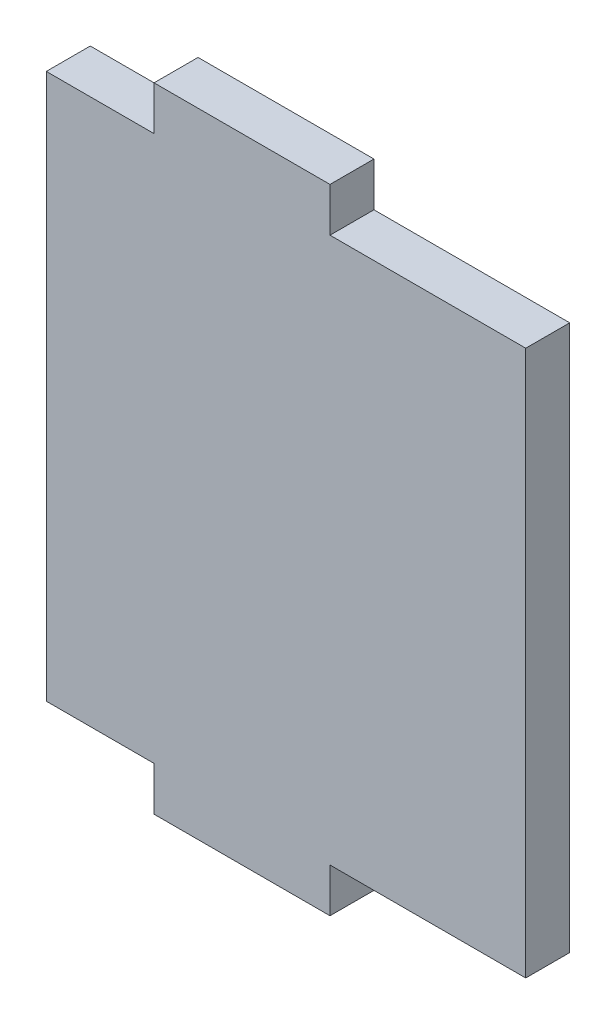
ISO-10303-21;
HEADER;
FILE_DESCRIPTION(('STEP AP214'),'2;1');
FILE_NAME('part.step','',(''),(''),'','','');
FILE_SCHEMA(('AUTOMOTIVE_DESIGN { 1 0 10303 214 1 1 1 1 }'));
ENDSEC;
DATA;
#1=APPLICATION_CONTEXT('core data for automotive mechanical design processes');
#2=APPLICATION_PROTOCOL_DEFINITION('international standard','automotive_design',2000,#1);
#3=PRODUCT_CONTEXT('',#1,'mechanical');
#4=PRODUCT('Part','Part','',(#3));
#5=PRODUCT_RELATED_PRODUCT_CATEGORY('part','',(#4));
#6=PRODUCT_DEFINITION_FORMATION('','',#4);
#7=PRODUCT_DEFINITION_CONTEXT('part definition',#1,'design');
#8=PRODUCT_DEFINITION('design','',#6,#7);
#9=PRODUCT_DEFINITION_SHAPE('','',#8);
#10=(LENGTH_UNIT() NAMED_UNIT(*) SI_UNIT(.MILLI.,.METRE.));
#11=(NAMED_UNIT(*) PLANE_ANGLE_UNIT() SI_UNIT($,.RADIAN.));
#12=(NAMED_UNIT(*) SI_UNIT($,.STERADIAN.) SOLID_ANGLE_UNIT());
#13=UNCERTAINTY_MEASURE_WITH_UNIT(LENGTH_MEASURE(1.E-05),#10,'distance_accuracy_value','');
#14=(GEOMETRIC_REPRESENTATION_CONTEXT(3) GLOBAL_UNCERTAINTY_ASSIGNED_CONTEXT((#13)) GLOBAL_UNIT_ASSIGNED_CONTEXT((#10,
#11,#12)) REPRESENTATION_CONTEXT('',''));
#15=CARTESIAN_POINT('',(0.,0.,0.));
#16=DIRECTION('',(0.,0.,1.));
#17=DIRECTION('',(1.,0.,0.));
#18=AXIS2_PLACEMENT_3D('',#15,#16,#17);
#19=CARTESIAN_POINT('',(27.25,0.,5.));
#20=DIRECTION('',(1.,0.,0.));
#21=DIRECTION('',(0.,1.,0.));
#22=AXIS2_PLACEMENT_3D('',#19,#20,#21);
#23=PLANE('',#22);
#24=DIRECTION('',(0.,-1.,0.));
#25=VECTOR('',#24,1.);
#26=CARTESIAN_POINT('',(27.25,0.,0.));
#27=LINE('',#26,#25);
#28=CARTESIAN_POINT('',(27.25,31.,0.));
#29=VERTEX_POINT('',#28);
#30=CARTESIAN_POINT('',(27.25,-31.,0.));
#31=VERTEX_POINT('',#30);
#32=EDGE_CURVE('E150',#29,#31,#27,.T.);
#33=ORIENTED_EDGE('',*,*,#32,.F.);
#34=DIRECTION('',(0.,0.,-1.));
#35=VECTOR('',#34,1.);
#36=CARTESIAN_POINT('',(27.25,31.,5.));
#37=LINE('',#36,#35);
#38=CARTESIAN_POINT('',(27.25,31.,5.));
#39=VERTEX_POINT('',#38);
#40=EDGE_CURVE('E11',#39,#29,#37,.T.);
#41=ORIENTED_EDGE('',*,*,#40,.F.);
#42=DIRECTION('',(0.,-1.,0.));
#43=VECTOR('',#42,1.);
#44=CARTESIAN_POINT('',(27.25,0.,5.));
#45=LINE('',#44,#43);
#46=CARTESIAN_POINT('',(27.25,-31.,5.));
#47=VERTEX_POINT('',#46);
#48=EDGE_CURVE('E179',#39,#47,#45,.T.);
#49=ORIENTED_EDGE('',*,*,#48,.T.);
#50=DIRECTION('',(0.,0.,-1.));
#51=VECTOR('',#50,1.);
#52=CARTESIAN_POINT('',(27.25,-31.,5.));
#53=LINE('',#52,#51);
#54=EDGE_CURVE('E96',#47,#31,#53,.T.);
#55=ORIENTED_EDGE('',*,*,#54,.T.);
#56=EDGE_LOOP('',(#33,#41,#49,#55));
#57=FACE_BOUND('',#56,.T.);
#58=ADVANCED_FACE('F34',(#57),#23,.T.);
#59=CARTESIAN_POINT('',(0.,31.,5.));
#60=DIRECTION('',(0.,1.,0.));
#61=DIRECTION('',(0.,0.,1.));
#62=AXIS2_PLACEMENT_3D('',#59,#60,#61);
#63=PLANE('',#62);
#64=DIRECTION('',(1.,0.,0.));
#65=VECTOR('',#64,1.);
#66=CARTESIAN_POINT('',(0.,31.,0.));
#67=LINE('',#66,#65);
#68=CARTESIAN_POINT('',(5.,31.,0.));
#69=VERTEX_POINT('',#68);
#70=EDGE_CURVE('E153',#69,#29,#67,.T.);
#71=ORIENTED_EDGE('',*,*,#70,.F.);
#72=DIRECTION('',(0.,0.,-1.));
#73=VECTOR('',#72,1.);
#74=CARTESIAN_POINT('',(5.,31.,5.));
#75=LINE('',#74,#73);
#76=CARTESIAN_POINT('',(5.,31.,5.));
#77=VERTEX_POINT('',#76);
#78=EDGE_CURVE('E42',#77,#69,#75,.T.);
#79=ORIENTED_EDGE('',*,*,#78,.F.);
#80=DIRECTION('',(1.,0.,0.));
#81=VECTOR('',#80,1.);
#82=CARTESIAN_POINT('',(0.,31.,5.));
#83=LINE('',#82,#81);
#84=EDGE_CURVE('E212',#77,#39,#83,.T.);
#85=ORIENTED_EDGE('',*,*,#84,.T.);
#86=ORIENTED_EDGE('',*,*,#40,.T.);
#87=EDGE_LOOP('',(#71,#79,#85,#86));
#88=FACE_BOUND('',#87,.T.);
#89=ADVANCED_FACE('F211',(#88),#63,.T.);
#90=CARTESIAN_POINT('',(5.,0.,5.));
#91=DIRECTION('',(-1.,0.,0.));
#92=DIRECTION('',(0.,0.,1.));
#93=AXIS2_PLACEMENT_3D('',#90,#91,#92);
#94=PLANE('',#93);
#95=DIRECTION('',(0.,1.,0.));
#96=VECTOR('',#95,1.);
#97=CARTESIAN_POINT('',(5.,0.,0.));
#98=LINE('',#97,#96);
#99=CARTESIAN_POINT('',(5.,36.,0.));
#100=VERTEX_POINT('',#99);
#101=EDGE_CURVE('E156',#69,#100,#98,.T.);
#102=ORIENTED_EDGE('',*,*,#101,.T.);
#103=DIRECTION('',(0.,0.,-1.));
#104=VECTOR('',#103,1.);
#105=CARTESIAN_POINT('',(5.,36.,5.));
#106=LINE('',#105,#104);
#107=CARTESIAN_POINT('',(5.,36.,5.));
#108=VERTEX_POINT('',#107);
#109=EDGE_CURVE('E195',#108,#100,#106,.T.);
#110=ORIENTED_EDGE('',*,*,#109,.F.);
#111=DIRECTION('',(0.,1.,0.));
#112=VECTOR('',#111,1.);
#113=CARTESIAN_POINT('',(5.,0.,5.));
#114=LINE('',#113,#112);
#115=EDGE_CURVE('E202',#77,#108,#114,.T.);
#116=ORIENTED_EDGE('',*,*,#115,.F.);
#117=ORIENTED_EDGE('',*,*,#78,.T.);
#118=EDGE_LOOP('',(#102,#110,#116,#117));
#119=FACE_BOUND('',#118,.T.);
#120=ADVANCED_FACE('F200',(#119),#94,.F.);
#121=CARTESIAN_POINT('',(0.,36.,5.));
#122=DIRECTION('',(0.,-1.,0.));
#123=DIRECTION('',(1.,0.,0.));
#124=AXIS2_PLACEMENT_3D('',#121,#122,#123);
#125=PLANE('',#124);
#126=DIRECTION('',(-1.,0.,0.));
#127=VECTOR('',#126,1.);
#128=CARTESIAN_POINT('',(0.,36.,0.));
#129=LINE('',#128,#127);
#130=CARTESIAN_POINT('',(-15.,36.,0.));
#131=VERTEX_POINT('',#130);
#132=EDGE_CURVE('E158',#100,#131,#129,.T.);
#133=ORIENTED_EDGE('',*,*,#132,.T.);
#134=DIRECTION('',(0.,0.,-1.));
#135=VECTOR('',#134,1.);
#136=CARTESIAN_POINT('',(-15.,36.,5.));
#137=LINE('',#136,#135);
#138=CARTESIAN_POINT('',(-15.,36.,5.));
#139=VERTEX_POINT('',#138);
#140=EDGE_CURVE('E192',#139,#131,#137,.T.);
#141=ORIENTED_EDGE('',*,*,#140,.F.);
#142=DIRECTION('',(-1.,0.,0.));
#143=VECTOR('',#142,1.);
#144=CARTESIAN_POINT('',(0.,36.,5.));
#145=LINE('',#144,#143);
#146=EDGE_CURVE('E218',#108,#139,#145,.T.);
#147=ORIENTED_EDGE('',*,*,#146,.F.);
#148=ORIENTED_EDGE('',*,*,#109,.T.);
#149=EDGE_LOOP('',(#133,#141,#147,#148));
#150=FACE_BOUND('',#149,.T.);
#151=ADVANCED_FACE('F252',(#150),#125,.F.);
#152=CARTESIAN_POINT('',(-15.,0.,5.));
#153=DIRECTION('',(1.,0.,0.));
#154=DIRECTION('',(0.,0.,-1.));
#155=AXIS2_PLACEMENT_3D('',#152,#153,#154);
#156=PLANE('',#155);
#157=DIRECTION('',(0.,-1.,0.));
#158=VECTOR('',#157,1.);
#159=CARTESIAN_POINT('',(-15.,0.,0.));
#160=LINE('',#159,#158);
#161=CARTESIAN_POINT('',(-15.,31.,0.));
#162=VERTEX_POINT('',#161);
#163=EDGE_CURVE('E160',#131,#162,#160,.T.);
#164=ORIENTED_EDGE('',*,*,#163,.T.);
#165=DIRECTION('',(0.,0.,-1.));
#166=VECTOR('',#165,1.);
#167=CARTESIAN_POINT('',(-15.,31.,5.));
#168=LINE('',#167,#166);
#169=CARTESIAN_POINT('',(-15.,31.,5.));
#170=VERTEX_POINT('',#169);
#171=EDGE_CURVE('E190',#170,#162,#168,.T.);
#172=ORIENTED_EDGE('',*,*,#171,.F.);
#173=DIRECTION('',(0.,-1.,0.));
#174=VECTOR('',#173,1.);
#175=CARTESIAN_POINT('',(-15.,0.,5.));
#176=LINE('',#175,#174);
#177=EDGE_CURVE('E220',#139,#170,#176,.T.);
#178=ORIENTED_EDGE('',*,*,#177,.F.);
#179=ORIENTED_EDGE('',*,*,#140,.T.);
#180=EDGE_LOOP('',(#164,#172,#178,#179));
#181=FACE_BOUND('',#180,.T.);
#182=ADVANCED_FACE('F247',(#181),#156,.F.);
#183=CARTESIAN_POINT('',(0.,31.,5.));
#184=DIRECTION('',(0.,1.,0.));
#185=DIRECTION('',(0.,0.,1.));
#186=AXIS2_PLACEMENT_3D('',#183,#184,#185);
#187=PLANE('',#186);
#188=DIRECTION('',(1.,0.,0.));
#189=VECTOR('',#188,1.);
#190=CARTESIAN_POINT('',(0.,31.,0.));
#191=LINE('',#190,#189);
#192=CARTESIAN_POINT('',(-27.25,31.,0.));
#193=VERTEX_POINT('',#192);
#194=EDGE_CURVE('E163',#193,#162,#191,.T.);
#195=ORIENTED_EDGE('',*,*,#194,.F.);
#196=DIRECTION('',(0.,0.,-1.));
#197=VECTOR('',#196,1.);
#198=CARTESIAN_POINT('',(-27.25,31.,5.));
#199=LINE('',#198,#197);
#200=CARTESIAN_POINT('',(-27.25,31.,5.));
#201=VERTEX_POINT('',#200);
#202=EDGE_CURVE('E188',#201,#193,#199,.T.);
#203=ORIENTED_EDGE('',*,*,#202,.F.);
#204=DIRECTION('',(1.,0.,0.));
#205=VECTOR('',#204,1.);
#206=CARTESIAN_POINT('',(0.,31.,5.));
#207=LINE('',#206,#205);
#208=EDGE_CURVE('E222',#201,#170,#207,.T.);
#209=ORIENTED_EDGE('',*,*,#208,.T.);
#210=ORIENTED_EDGE('',*,*,#171,.T.);
#211=EDGE_LOOP('',(#195,#203,#209,#210));
#212=FACE_BOUND('',#211,.T.);
#213=ADVANCED_FACE('F244',(#212),#187,.T.);
#214=CARTESIAN_POINT('',(-27.25,0.,5.));
#215=DIRECTION('',(1.,0.,0.));
#216=DIRECTION('',(0.,1.,0.));
#217=AXIS2_PLACEMENT_3D('',#214,#215,#216);
#218=PLANE('',#217);
#219=DIRECTION('',(0.,-1.,0.));
#220=VECTOR('',#219,1.);
#221=CARTESIAN_POINT('',(-27.25,0.,0.));
#222=LINE('',#221,#220);
#223=CARTESIAN_POINT('',(-27.25,-31.,0.));
#224=VERTEX_POINT('',#223);
#225=EDGE_CURVE('E166',#193,#224,#222,.T.);
#226=ORIENTED_EDGE('',*,*,#225,.T.);
#227=DIRECTION('',(0.,0.,-1.));
#228=VECTOR('',#227,1.);
#229=CARTESIAN_POINT('',(-27.25,-31.,5.));
#230=LINE('',#229,#228);
#231=CARTESIAN_POINT('',(-27.25,-31.,5.));
#232=VERTEX_POINT('',#231);
#233=EDGE_CURVE('E185',#232,#224,#230,.T.);
#234=ORIENTED_EDGE('',*,*,#233,.F.);
#235=DIRECTION('',(0.,-1.,0.));
#236=VECTOR('',#235,1.);
#237=CARTESIAN_POINT('',(-27.25,0.,5.));
#238=LINE('',#237,#236);
#239=EDGE_CURVE('E225',#201,#232,#238,.T.);
#240=ORIENTED_EDGE('',*,*,#239,.F.);
#241=ORIENTED_EDGE('',*,*,#202,.T.);
#242=EDGE_LOOP('',(#226,#234,#240,#241));
#243=FACE_BOUND('',#242,.T.);
#244=ADVANCED_FACE('F241',(#243),#218,.F.);
#245=CARTESIAN_POINT('',(0.,-31.,5.));
#246=DIRECTION('',(0.,1.,0.));
#247=DIRECTION('',(0.,0.,1.));
#248=AXIS2_PLACEMENT_3D('',#245,#246,#247);
#249=PLANE('',#248);
#250=DIRECTION('',(1.,0.,0.));
#251=VECTOR('',#250,1.);
#252=CARTESIAN_POINT('',(0.,-31.,0.));
#253=LINE('',#252,#251);
#254=CARTESIAN_POINT('',(-15.,-31.,0.));
#255=VERTEX_POINT('',#254);
#256=EDGE_CURVE('E168',#224,#255,#253,.T.);
#257=ORIENTED_EDGE('',*,*,#256,.T.);
#258=DIRECTION('',(0.,0.,-1.));
#259=VECTOR('',#258,1.);
#260=CARTESIAN_POINT('',(-15.,-31.,5.));
#261=LINE('',#260,#259);
#262=CARTESIAN_POINT('',(-15.,-31.,5.));
#263=VERTEX_POINT('',#262);
#264=EDGE_CURVE('E183',#263,#255,#261,.T.);
#265=ORIENTED_EDGE('',*,*,#264,.F.);
#266=DIRECTION('',(1.,0.,0.));
#267=VECTOR('',#266,1.);
#268=CARTESIAN_POINT('',(0.,-31.,5.));
#269=LINE('',#268,#267);
#270=EDGE_CURVE('E227',#232,#263,#269,.T.);
#271=ORIENTED_EDGE('',*,*,#270,.F.);
#272=ORIENTED_EDGE('',*,*,#233,.T.);
#273=EDGE_LOOP('',(#257,#265,#271,#272));
#274=FACE_BOUND('',#273,.T.);
#275=ADVANCED_FACE('F236',(#274),#249,.F.);
#276=CARTESIAN_POINT('',(-15.,0.,5.));
#277=DIRECTION('',(-1.,0.,0.));
#278=DIRECTION('',(0.,0.,1.));
#279=AXIS2_PLACEMENT_3D('',#276,#277,#278);
#280=PLANE('',#279);
#281=DIRECTION('',(0.,1.,0.));
#282=VECTOR('',#281,1.);
#283=CARTESIAN_POINT('',(-15.,0.,0.));
#284=LINE('',#283,#282);
#285=CARTESIAN_POINT('',(-15.,-36.,0.));
#286=VERTEX_POINT('',#285);
#287=EDGE_CURVE('E171',#286,#255,#284,.T.);
#288=ORIENTED_EDGE('',*,*,#287,.F.);
#289=DIRECTION('',(0.,0.,-1.));
#290=VECTOR('',#289,1.);
#291=CARTESIAN_POINT('',(-15.,-36.,5.));
#292=LINE('',#291,#290);
#293=CARTESIAN_POINT('',(-15.,-36.,5.));
#294=VERTEX_POINT('',#293);
#295=EDGE_CURVE('E137',#294,#286,#292,.T.);
#296=ORIENTED_EDGE('',*,*,#295,.F.);
#297=DIRECTION('',(0.,1.,0.));
#298=VECTOR('',#297,1.);
#299=CARTESIAN_POINT('',(-15.,0.,5.));
#300=LINE('',#299,#298);
#301=EDGE_CURVE('E143',#294,#263,#300,.T.);
#302=ORIENTED_EDGE('',*,*,#301,.T.);
#303=ORIENTED_EDGE('',*,*,#264,.T.);
#304=EDGE_LOOP('',(#288,#296,#302,#303));
#305=FACE_BOUND('',#304,.T.);
#306=ADVANCED_FACE('F230',(#305),#280,.T.);
#307=CARTESIAN_POINT('',(0.,-36.,5.));
#308=DIRECTION('',(0.,-1.,0.));
#309=DIRECTION('',(1.,0.,0.));
#310=AXIS2_PLACEMENT_3D('',#307,#308,#309);
#311=PLANE('',#310);
#312=DIRECTION('',(-1.,0.,0.));
#313=VECTOR('',#312,1.);
#314=CARTESIAN_POINT('',(0.,-36.,0.));
#315=LINE('',#314,#313);
#316=CARTESIAN_POINT('',(5.,-36.,0.));
#317=VERTEX_POINT('',#316);
#318=EDGE_CURVE('E132',#317,#286,#315,.T.);
#319=ORIENTED_EDGE('',*,*,#318,.F.);
#320=DIRECTION('',(0.,0.,-1.));
#321=VECTOR('',#320,1.);
#322=CARTESIAN_POINT('',(5.,-36.,5.));
#323=LINE('',#322,#321);
#324=CARTESIAN_POINT('',(5.,-36.,5.));
#325=VERTEX_POINT('',#324);
#326=EDGE_CURVE('E127',#325,#317,#323,.T.);
#327=ORIENTED_EDGE('',*,*,#326,.F.);
#328=DIRECTION('',(-1.,0.,0.));
#329=VECTOR('',#328,1.);
#330=CARTESIAN_POINT('',(0.,-36.,5.));
#331=LINE('',#330,#329);
#332=EDGE_CURVE('E130',#325,#294,#331,.T.);
#333=ORIENTED_EDGE('',*,*,#332,.T.);
#334=ORIENTED_EDGE('',*,*,#295,.T.);
#335=EDGE_LOOP('',(#319,#327,#333,#334));
#336=FACE_BOUND('',#335,.T.);
#337=ADVANCED_FACE('F129',(#336),#311,.T.);
#338=CARTESIAN_POINT('',(5.,0.,5.));
#339=DIRECTION('',(1.,0.,0.));
#340=DIRECTION('',(0.,0.,-1.));
#341=AXIS2_PLACEMENT_3D('',#338,#339,#340);
#342=PLANE('',#341);
#343=DIRECTION('',(0.,-1.,0.));
#344=VECTOR('',#343,1.);
#345=CARTESIAN_POINT('',(5.,0.,0.));
#346=LINE('',#345,#344);
#347=CARTESIAN_POINT('',(5.,-31.,0.));
#348=VERTEX_POINT('',#347);
#349=EDGE_CURVE('E175',#348,#317,#346,.T.);
#350=ORIENTED_EDGE('',*,*,#349,.F.);
#351=DIRECTION('',(0.,0.,-1.));
#352=VECTOR('',#351,1.);
#353=CARTESIAN_POINT('',(5.,-31.,5.));
#354=LINE('',#353,#352);
#355=CARTESIAN_POINT('',(5.,-31.,5.));
#356=VERTEX_POINT('',#355);
#357=EDGE_CURVE('E89',#356,#348,#354,.T.);
#358=ORIENTED_EDGE('',*,*,#357,.F.);
#359=DIRECTION('',(0.,-1.,0.));
#360=VECTOR('',#359,1.);
#361=CARTESIAN_POINT('',(5.,0.,5.));
#362=LINE('',#361,#360);
#363=EDGE_CURVE('E141',#356,#325,#362,.T.);
#364=ORIENTED_EDGE('',*,*,#363,.T.);
#365=ORIENTED_EDGE('',*,*,#326,.T.);
#366=EDGE_LOOP('',(#350,#358,#364,#365));
#367=FACE_BOUND('',#366,.T.);
#368=ADVANCED_FACE('F145',(#367),#342,.T.);
#369=CARTESIAN_POINT('',(0.,-31.,5.));
#370=DIRECTION('',(0.,1.,0.));
#371=DIRECTION('',(0.,0.,1.));
#372=AXIS2_PLACEMENT_3D('',#369,#370,#371);
#373=PLANE('',#372);
#374=DIRECTION('',(1.,0.,0.));
#375=VECTOR('',#374,1.);
#376=CARTESIAN_POINT('',(0.,-31.,0.));
#377=LINE('',#376,#375);
#378=EDGE_CURVE('E177',#348,#31,#377,.T.);
#379=ORIENTED_EDGE('',*,*,#378,.T.);
#380=ORIENTED_EDGE('',*,*,#54,.F.);
#381=DIRECTION('',(1.,0.,0.));
#382=VECTOR('',#381,1.);
#383=CARTESIAN_POINT('',(0.,-31.,5.));
#384=LINE('',#383,#382);
#385=EDGE_CURVE('E50',#356,#47,#384,.T.);
#386=ORIENTED_EDGE('',*,*,#385,.F.);
#387=ORIENTED_EDGE('',*,*,#357,.T.);
#388=EDGE_LOOP('',(#379,#380,#386,#387));
#389=FACE_BOUND('',#388,.T.);
#390=ADVANCED_FACE('F213',(#389),#373,.F.);
#391=CARTESIAN_POINT('',(0.,0.,5.));
#392=DIRECTION('',(0.,0.,1.));
#393=DIRECTION('',(1.,0.,0.));
#394=AXIS2_PLACEMENT_3D('',#391,#392,#393);
#395=PLANE('',#394);
#396=ORIENTED_EDGE('',*,*,#48,.F.);
#397=ORIENTED_EDGE('',*,*,#84,.F.);
#398=ORIENTED_EDGE('',*,*,#115,.T.);
#399=ORIENTED_EDGE('',*,*,#146,.T.);
#400=ORIENTED_EDGE('',*,*,#177,.T.);
#401=ORIENTED_EDGE('',*,*,#208,.F.);
#402=ORIENTED_EDGE('',*,*,#239,.T.);
#403=ORIENTED_EDGE('',*,*,#270,.T.);
#404=ORIENTED_EDGE('',*,*,#301,.F.);
#405=ORIENTED_EDGE('',*,*,#332,.F.);
#406=ORIENTED_EDGE('',*,*,#363,.F.);
#407=ORIENTED_EDGE('',*,*,#385,.T.);
#408=EDGE_LOOP('',(#396,#397,#398,#399,#400,#401,#402,#403,#404,#405,#406,#407));
#409=FACE_BOUND('',#408,.T.);
#410=ADVANCED_FACE('F140',(#409),#395,.T.);
#411=CARTESIAN_POINT('',(0.,0.,0.));
#412=DIRECTION('',(0.,0.,1.));
#413=DIRECTION('',(1.,0.,0.));
#414=AXIS2_PLACEMENT_3D('',#411,#412,#413);
#415=PLANE('',#414);
#416=ORIENTED_EDGE('',*,*,#32,.T.);
#417=ORIENTED_EDGE('',*,*,#378,.F.);
#418=ORIENTED_EDGE('',*,*,#349,.T.);
#419=ORIENTED_EDGE('',*,*,#318,.T.);
#420=ORIENTED_EDGE('',*,*,#287,.T.);
#421=ORIENTED_EDGE('',*,*,#256,.F.);
#422=ORIENTED_EDGE('',*,*,#225,.F.);
#423=ORIENTED_EDGE('',*,*,#194,.T.);
#424=ORIENTED_EDGE('',*,*,#163,.F.);
#425=ORIENTED_EDGE('',*,*,#132,.F.);
#426=ORIENTED_EDGE('',*,*,#101,.F.);
#427=ORIENTED_EDGE('',*,*,#70,.T.);
#428=EDGE_LOOP('',(#416,#417,#418,#419,#420,#421,#422,#423,#424,#425,#426,#427));
#429=FACE_BOUND('',#428,.T.);
#430=ADVANCED_FACE('F209',(#429),#415,.F.);
#431=CLOSED_SHELL('',(#58,#89,#120,#151,#182,#213,#244,#275,#306,#337,#368,#390,#410,#430));
#432=MANIFOLD_SOLID_BREP('B2',#431);
#433=ADVANCED_BREP_SHAPE_REPRESENTATION('',(#18,#432),#14);
#434=SHAPE_DEFINITION_REPRESENTATION(#9,#433);
ENDSEC;
END-ISO-10303-21;
